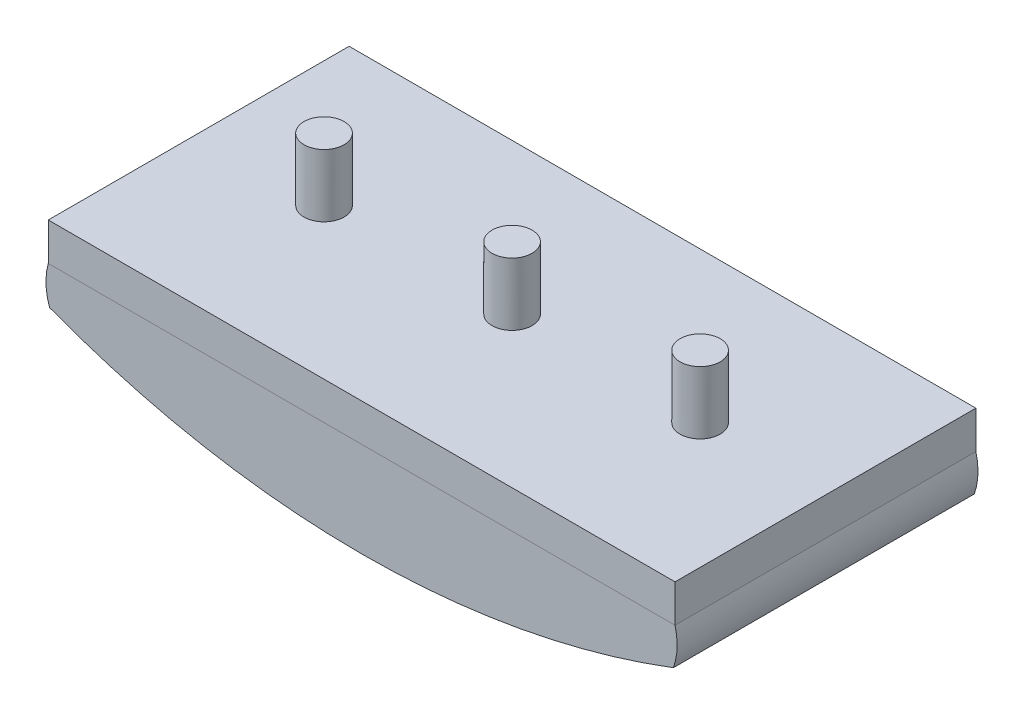
ISO-10303-21;
HEADER;
FILE_DESCRIPTION(('STEP AP214'),'2;1');
FILE_NAME('part.step','',(''),(''),'','','');
FILE_SCHEMA(('AUTOMOTIVE_DESIGN { 1 0 10303 214 1 1 1 1 }'));
ENDSEC;
DATA;
#1=APPLICATION_CONTEXT('core data for automotive mechanical design processes');
#2=APPLICATION_PROTOCOL_DEFINITION('international standard','automotive_design',2000,#1);
#3=PRODUCT_CONTEXT('',#1,'mechanical');
#4=PRODUCT('Part','Part','',(#3));
#5=PRODUCT_RELATED_PRODUCT_CATEGORY('part','',(#4));
#6=PRODUCT_DEFINITION_FORMATION('','',#4);
#7=PRODUCT_DEFINITION_CONTEXT('part definition',#1,'design');
#8=PRODUCT_DEFINITION('design','',#6,#7);
#9=PRODUCT_DEFINITION_SHAPE('','',#8);
#10=(LENGTH_UNIT() NAMED_UNIT(*) SI_UNIT(.MILLI.,.METRE.));
#11=(NAMED_UNIT(*) PLANE_ANGLE_UNIT() SI_UNIT($,.RADIAN.));
#12=(NAMED_UNIT(*) SI_UNIT($,.STERADIAN.) SOLID_ANGLE_UNIT());
#13=UNCERTAINTY_MEASURE_WITH_UNIT(LENGTH_MEASURE(1.E-05),#10,'distance_accuracy_value','');
#14=(GEOMETRIC_REPRESENTATION_CONTEXT(3) GLOBAL_UNCERTAINTY_ASSIGNED_CONTEXT((#13)) GLOBAL_UNIT_ASSIGNED_CONTEXT((#10,
#11,#12)) REPRESENTATION_CONTEXT('',''));
#15=CARTESIAN_POINT('',(0.,0.,0.));
#16=DIRECTION('',(0.,0.,1.));
#17=DIRECTION('',(1.,0.,0.));
#18=AXIS2_PLACEMENT_3D('',#15,#16,#17);
#19=CARTESIAN_POINT('',(4.81764805719499,-1.338008668509,0.));
#20=DIRECTION('',(0.,0.,-1.));
#21=DIRECTION('',(-1.,0.,0.));
#22=AXIS2_PLACEMENT_3D('',#19,#20,#21);
#23=CYLINDRICAL_SURFACE('',#22,5.);
#24=CARTESIAN_POINT('',(4.81764805719499,-1.338008668509,-24.));
#25=DIRECTION('',(0.,0.,-1.));
#26=DIRECTION('',(1.,0.,0.));
#27=AXIS2_PLACEMENT_3D('',#24,#25,#26);
#28=CIRCLE('',#27,5.);
#29=CARTESIAN_POINT('',(0.10195247604803,-2.99999999999999,-24.));
#30=VERTEX_POINT('',#29);
#31=CARTESIAN_POINT('',(0.,0.,-24.));
#32=VERTEX_POINT('',#31);
#33=EDGE_CURVE('E108',#30,#32,#28,.T.);
#34=ORIENTED_EDGE('',*,*,#33,.F.);
#35=DIRECTION('',(0.,0.,-1.));
#36=VECTOR('',#35,1.);
#37=CARTESIAN_POINT('',(0.10195247604803,-2.99999999999999,0.));
#38=LINE('',#37,#36);
#39=CARTESIAN_POINT('',(0.10195247604803,-2.99999999999999,0.));
#40=VERTEX_POINT('',#39);
#41=EDGE_CURVE('E12',#40,#30,#38,.T.);
#42=ORIENTED_EDGE('',*,*,#41,.F.);
#43=CARTESIAN_POINT('',(4.81764805719499,-1.338008668509,0.));
#44=DIRECTION('',(0.,0.,-1.));
#45=DIRECTION('',(1.,0.,0.));
#46=AXIS2_PLACEMENT_3D('',#43,#44,#45);
#47=CIRCLE('',#46,5.);
#48=CARTESIAN_POINT('',(0.,0.,0.));
#49=VERTEX_POINT('',#48);
#50=EDGE_CURVE('E102',#40,#49,#47,.T.);
#51=ORIENTED_EDGE('',*,*,#50,.T.);
#52=DIRECTION('',(0.,0.,-1.));
#53=VECTOR('',#52,1.);
#54=CARTESIAN_POINT('',(0.,0.,0.));
#55=LINE('',#54,#53);
#56=EDGE_CURVE('E47',#49,#32,#55,.T.);
#57=ORIENTED_EDGE('',*,*,#56,.T.);
#58=EDGE_LOOP('',(#34,#42,#51,#57));
#59=FACE_BOUND('',#58,.T.);
#60=ADVANCED_FACE('F44',(#59),#23,.T.);
#61=CARTESIAN_POINT('',(24.9845146144658,62.4282668380248,0.));
#62=DIRECTION('',(0.,0.,-1.));
#63=DIRECTION('',(-1.,0.,0.));
#64=AXIS2_PLACEMENT_3D('',#61,#62,#63);
#65=CYLINDRICAL_SURFACE('',#64,70.);
#66=CARTESIAN_POINT('',(24.9845146144658,62.4282668380248,-24.));
#67=DIRECTION('',(0.,0.,-1.));
#68=DIRECTION('',(1.,0.,0.));
#69=AXIS2_PLACEMENT_3D('',#66,#67,#68);
#70=CIRCLE('',#69,70.);
#71=CARTESIAN_POINT('',(49.8670767528836,-3.,-24.));
#72=VERTEX_POINT('',#71);
#73=EDGE_CURVE('E104',#72,#30,#70,.T.);
#74=ORIENTED_EDGE('',*,*,#73,.F.);
#75=DIRECTION('',(0.,0.,-1.));
#76=VECTOR('',#75,1.);
#77=CARTESIAN_POINT('',(49.8670767528836,-3.,0.));
#78=LINE('',#77,#76);
#79=CARTESIAN_POINT('',(49.8670767528836,-3.,0.));
#80=VERTEX_POINT('',#79);
#81=EDGE_CURVE('E53',#80,#72,#78,.T.);
#82=ORIENTED_EDGE('',*,*,#81,.F.);
#83=CARTESIAN_POINT('',(24.9845146144658,62.4282668380248,0.));
#84=DIRECTION('',(0.,0.,-1.));
#85=DIRECTION('',(1.,0.,0.));
#86=AXIS2_PLACEMENT_3D('',#83,#84,#85);
#87=CIRCLE('',#86,70.);
#88=EDGE_CURVE('E99',#80,#40,#87,.T.);
#89=ORIENTED_EDGE('',*,*,#88,.T.);
#90=ORIENTED_EDGE('',*,*,#41,.T.);
#91=EDGE_LOOP('',(#74,#82,#89,#90));
#92=FACE_BOUND('',#91,.T.);
#93=ADVANCED_FACE('F118',(#92),#65,.T.);
#94=CARTESIAN_POINT('',(45.1689799764267,-1.28889314213146,0.));
#95=DIRECTION('',(0.,0.,-1.));
#96=DIRECTION('',(-1.,0.,0.));
#97=AXIS2_PLACEMENT_3D('',#94,#95,#96);
#98=CYLINDRICAL_SURFACE('',#97,5.);
#99=CARTESIAN_POINT('',(45.1689799764267,-1.28889314213146,-24.));
#100=DIRECTION('',(0.,0.,-1.));
#101=DIRECTION('',(-1.,0.,0.));
#102=AXIS2_PLACEMENT_3D('',#99,#100,#101);
#103=CIRCLE('',#102,5.);
#104=CARTESIAN_POINT('',(50.,0.,-24.));
#105=VERTEX_POINT('',#104);
#106=EDGE_CURVE('E94',#105,#72,#103,.T.);
#107=ORIENTED_EDGE('',*,*,#106,.F.);
#108=DIRECTION('',(0.,0.,-1.));
#109=VECTOR('',#108,1.);
#110=CARTESIAN_POINT('',(50.,0.,0.));
#111=LINE('',#110,#109);
#112=CARTESIAN_POINT('',(50.,0.,0.));
#113=VERTEX_POINT('',#112);
#114=EDGE_CURVE('E89',#113,#105,#111,.T.);
#115=ORIENTED_EDGE('',*,*,#114,.F.);
#116=CARTESIAN_POINT('',(45.1689799764267,-1.28889314213146,0.));
#117=DIRECTION('',(0.,0.,-1.));
#118=DIRECTION('',(-1.,0.,0.));
#119=AXIS2_PLACEMENT_3D('',#116,#117,#118);
#120=CIRCLE('',#119,5.);
#121=EDGE_CURVE('E92',#113,#80,#120,.T.);
#122=ORIENTED_EDGE('',*,*,#121,.T.);
#123=ORIENTED_EDGE('',*,*,#81,.T.);
#124=EDGE_LOOP('',(#107,#115,#122,#123));
#125=FACE_BOUND('',#124,.T.);
#126=ADVANCED_FACE('F91',(#125),#98,.T.);
#127=CARTESIAN_POINT('',(0.,0.,0.));
#128=DIRECTION('',(0.,1.,0.));
#129=DIRECTION('',(0.,0.,1.));
#130=AXIS2_PLACEMENT_3D('',#127,#128,#129);
#131=PLANE('',#130);
#132=DIRECTION('',(1.,0.,0.));
#133=VECTOR('',#132,1.);
#134=CARTESIAN_POINT('',(0.,0.,-24.));
#135=LINE('',#134,#133);
#136=EDGE_CURVE('E111',#32,#105,#135,.T.);
#137=ORIENTED_EDGE('',*,*,#136,.F.);
#138=ORIENTED_EDGE('',*,*,#56,.F.);
#139=DIRECTION('',(1.,0.,0.));
#140=VECTOR('',#139,1.);
#141=CARTESIAN_POINT('',(0.,0.,0.));
#142=LINE('',#141,#140);
#143=EDGE_CURVE('E98',#49,#113,#142,.T.);
#144=ORIENTED_EDGE('',*,*,#143,.T.);
#145=ORIENTED_EDGE('',*,*,#114,.T.);
#146=EDGE_LOOP('',(#137,#138,#144,#145));
#147=FACE_BOUND('',#146,.T.);
#148=ADVANCED_FACE('F101',(#147),#131,.T.);
#149=CARTESIAN_POINT('',(4.81764805719499,-1.338008668509,0.));
#150=DIRECTION('',(0.,0.,1.));
#151=DIRECTION('',(1.,0.,0.));
#152=AXIS2_PLACEMENT_3D('',#149,#150,#151);
#153=PLANE('',#152);
#154=ORIENTED_EDGE('',*,*,#50,.F.);
#155=ORIENTED_EDGE('',*,*,#88,.F.);
#156=ORIENTED_EDGE('',*,*,#121,.F.);
#157=ORIENTED_EDGE('',*,*,#143,.F.);
#158=EDGE_LOOP('',(#154,#155,#156,#157));
#159=FACE_BOUND('',#158,.T.);
#160=ADVANCED_FACE('F97',(#159),#153,.T.);
#161=CARTESIAN_POINT('',(4.81764805719499,-1.338008668509,-24.));
#162=DIRECTION('',(0.,0.,1.));
#163=DIRECTION('',(1.,0.,0.));
#164=AXIS2_PLACEMENT_3D('',#161,#162,#163);
#165=PLANE('',#164);
#166=ORIENTED_EDGE('',*,*,#33,.T.);
#167=ORIENTED_EDGE('',*,*,#136,.T.);
#168=ORIENTED_EDGE('',*,*,#106,.T.);
#169=ORIENTED_EDGE('',*,*,#73,.T.);
#170=EDGE_LOOP('',(#166,#167,#168,#169));
#171=FACE_BOUND('',#170,.T.);
#172=ADVANCED_FACE('F117',(#171),#165,.F.);
#173=CLOSED_SHELL('',(#60,#93,#126,#148,#160,#172));
#174=MANIFOLD_SOLID_BREP('B2',#173);
#175=CARTESIAN_POINT('',(0.,3.,0.));
#176=DIRECTION('',(1.,0.,0.));
#177=DIRECTION('',(0.,0.,-1.));
#178=AXIS2_PLACEMENT_3D('',#175,#176,#177);
#179=PLANE('',#178);
#180=DIRECTION('',(0.,0.,1.));
#181=VECTOR('',#180,1.);
#182=CARTESIAN_POINT('',(0.,0.,0.));
#183=LINE('',#182,#181);
#184=CARTESIAN_POINT('',(0.,0.,-24.));
#185=VERTEX_POINT('',#184);
#186=CARTESIAN_POINT('',(0.,0.,0.));
#187=VERTEX_POINT('',#186);
#188=EDGE_CURVE('E234',#185,#187,#183,.T.);
#189=ORIENTED_EDGE('',*,*,#188,.T.);
#190=DIRECTION('',(0.,-1.,0.));
#191=VECTOR('',#190,1.);
#192=CARTESIAN_POINT('',(0.,3.,0.));
#193=LINE('',#192,#191);
#194=CARTESIAN_POINT('',(0.,3.,0.));
#195=VERTEX_POINT('',#194);
#196=EDGE_CURVE('E225',#195,#187,#193,.T.);
#197=ORIENTED_EDGE('',*,*,#196,.F.);
#198=DIRECTION('',(0.,0.,1.));
#199=VECTOR('',#198,1.);
#200=CARTESIAN_POINT('',(0.,3.,0.));
#201=LINE('',#200,#199);
#202=CARTESIAN_POINT('',(0.,3.,-24.));
#203=VERTEX_POINT('',#202);
#204=EDGE_CURVE('E219',#203,#195,#201,.T.);
#205=ORIENTED_EDGE('',*,*,#204,.F.);
#206=DIRECTION('',(0.,-1.,0.));
#207=VECTOR('',#206,1.);
#208=CARTESIAN_POINT('',(0.,3.,-24.));
#209=LINE('',#208,#207);
#210=EDGE_CURVE('E230',#203,#185,#209,.T.);
#211=ORIENTED_EDGE('',*,*,#210,.T.);
#212=EDGE_LOOP('',(#189,#197,#205,#211));
#213=FACE_BOUND('',#212,.T.);
#214=ADVANCED_FACE('F167',(#213),#179,.F.);
#215=CARTESIAN_POINT('',(0.,3.,0.));
#216=DIRECTION('',(0.,0.,-1.));
#217=DIRECTION('',(-1.,0.,0.));
#218=AXIS2_PLACEMENT_3D('',#215,#216,#217);
#219=PLANE('',#218);
#220=DIRECTION('',(1.,0.,0.));
#221=VECTOR('',#220,1.);
#222=CARTESIAN_POINT('',(0.,0.,0.));
#223=LINE('',#222,#221);
#224=CARTESIAN_POINT('',(50.,0.,0.));
#225=VERTEX_POINT('',#224);
#226=EDGE_CURVE('E224',#187,#225,#223,.T.);
#227=ORIENTED_EDGE('',*,*,#226,.T.);
#228=DIRECTION('',(0.,-1.,0.));
#229=VECTOR('',#228,1.);
#230=CARTESIAN_POINT('',(50.,3.,0.));
#231=LINE('',#230,#229);
#232=CARTESIAN_POINT('',(50.,3.,0.));
#233=VERTEX_POINT('',#232);
#234=EDGE_CURVE('E222',#233,#225,#231,.T.);
#235=ORIENTED_EDGE('',*,*,#234,.F.);
#236=DIRECTION('',(1.,0.,0.));
#237=VECTOR('',#236,1.);
#238=CARTESIAN_POINT('',(0.,3.,0.));
#239=LINE('',#238,#237);
#240=EDGE_CURVE('E214',#195,#233,#239,.T.);
#241=ORIENTED_EDGE('',*,*,#240,.F.);
#242=ORIENTED_EDGE('',*,*,#196,.T.);
#243=EDGE_LOOP('',(#227,#235,#241,#242));
#244=FACE_BOUND('',#243,.T.);
#245=ADVANCED_FACE('F223',(#244),#219,.F.);
#246=CARTESIAN_POINT('',(50.,3.,0.));
#247=DIRECTION('',(-1.,0.,0.));
#248=DIRECTION('',(0.,0.,1.));
#249=AXIS2_PLACEMENT_3D('',#246,#247,#248);
#250=PLANE('',#249);
#251=DIRECTION('',(0.,0.,-1.));
#252=VECTOR('',#251,1.);
#253=CARTESIAN_POINT('',(50.,0.,0.));
#254=LINE('',#253,#252);
#255=CARTESIAN_POINT('',(50.,0.,-24.));
#256=VERTEX_POINT('',#255);
#257=EDGE_CURVE('E200',#225,#256,#254,.T.);
#258=ORIENTED_EDGE('',*,*,#257,.T.);
#259=DIRECTION('',(0.,-1.,0.));
#260=VECTOR('',#259,1.);
#261=CARTESIAN_POINT('',(50.,3.,-24.));
#262=LINE('',#261,#260);
#263=CARTESIAN_POINT('',(50.,3.,-24.));
#264=VERTEX_POINT('',#263);
#265=EDGE_CURVE('E226',#264,#256,#262,.T.);
#266=ORIENTED_EDGE('',*,*,#265,.F.);
#267=DIRECTION('',(0.,0.,-1.));
#268=VECTOR('',#267,1.);
#269=CARTESIAN_POINT('',(50.,3.,0.));
#270=LINE('',#269,#268);
#271=EDGE_CURVE('E217',#233,#264,#270,.T.);
#272=ORIENTED_EDGE('',*,*,#271,.F.);
#273=ORIENTED_EDGE('',*,*,#234,.T.);
#274=EDGE_LOOP('',(#258,#266,#272,#273));
#275=FACE_BOUND('',#274,.T.);
#276=ADVANCED_FACE('F228',(#275),#250,.F.);
#277=CARTESIAN_POINT('',(0.,3.,-24.));
#278=DIRECTION('',(0.,0.,1.));
#279=DIRECTION('',(1.,0.,0.));
#280=AXIS2_PLACEMENT_3D('',#277,#278,#279);
#281=PLANE('',#280);
#282=DIRECTION('',(-1.,0.,0.));
#283=VECTOR('',#282,1.);
#284=CARTESIAN_POINT('',(0.,0.,-24.));
#285=LINE('',#284,#283);
#286=EDGE_CURVE('E206',#256,#185,#285,.T.);
#287=ORIENTED_EDGE('',*,*,#286,.T.);
#288=ORIENTED_EDGE('',*,*,#210,.F.);
#289=DIRECTION('',(-1.,0.,0.));
#290=VECTOR('',#289,1.);
#291=CARTESIAN_POINT('',(0.,3.,-24.));
#292=LINE('',#291,#290);
#293=EDGE_CURVE('E183',#264,#203,#292,.T.);
#294=ORIENTED_EDGE('',*,*,#293,.F.);
#295=ORIENTED_EDGE('',*,*,#265,.T.);
#296=EDGE_LOOP('',(#287,#288,#294,#295));
#297=FACE_BOUND('',#296,.T.);
#298=ADVANCED_FACE('F254',(#297),#281,.F.);
#299=CARTESIAN_POINT('',(0.,3.,0.));
#300=DIRECTION('',(0.,-1.,0.));
#301=DIRECTION('',(0.,0.,-1.));
#302=AXIS2_PLACEMENT_3D('',#299,#300,#301);
#303=PLANE('',#302);
#304=CARTESIAN_POINT('',(40.,3.,-12.));
#305=DIRECTION('',(0.,-1.,0.));
#306=DIRECTION('',(0.,0.,-1.));
#307=AXIS2_PLACEMENT_3D('',#304,#305,#306);
#308=CIRCLE('',#307,1.6);
#309=CARTESIAN_POINT('',(40.,3.,-13.6));
#310=VERTEX_POINT('',#309);
#311=EDGE_CURVE('E42',#310,#310,#308,.F.);
#312=ORIENTED_EDGE('',*,*,#311,.F.);
#313=EDGE_LOOP('',(#312));
#314=FACE_BOUND('',#313,.T.);
#315=CARTESIAN_POINT('',(25.,3.,-12.));
#316=DIRECTION('',(0.,-1.,0.));
#317=DIRECTION('',(0.,0.,-1.));
#318=AXIS2_PLACEMENT_3D('',#315,#316,#317);
#319=CIRCLE('',#318,1.6);
#320=CARTESIAN_POINT('',(25.,3.,-13.6));
#321=VERTEX_POINT('',#320);
#322=EDGE_CURVE('E175',#321,#321,#319,.F.);
#323=ORIENTED_EDGE('',*,*,#322,.F.);
#324=EDGE_LOOP('',(#323));
#325=FACE_BOUND('',#324,.T.);
#326=CARTESIAN_POINT('',(9.99999999999999,3.,-12.));
#327=DIRECTION('',(0.,-1.,0.));
#328=DIRECTION('',(0.,0.,-1.));
#329=AXIS2_PLACEMENT_3D('',#326,#327,#328);
#330=CIRCLE('',#329,1.6);
#331=CARTESIAN_POINT('',(9.99999999999999,3.,-13.6));
#332=VERTEX_POINT('',#331);
#333=EDGE_CURVE('E244',#332,#332,#330,.F.);
#334=ORIENTED_EDGE('',*,*,#333,.F.);
#335=EDGE_LOOP('',(#334));
#336=FACE_BOUND('',#335,.T.);
#337=ORIENTED_EDGE('',*,*,#204,.T.);
#338=ORIENTED_EDGE('',*,*,#240,.T.);
#339=ORIENTED_EDGE('',*,*,#271,.T.);
#340=ORIENTED_EDGE('',*,*,#293,.T.);
#341=EDGE_LOOP('',(#337,#338,#339,#340));
#342=FACE_BOUND('',#341,.T.);
#343=ADVANCED_FACE('F215',(#314,#325,#336,#342),#303,.F.);
#344=CARTESIAN_POINT('',(0.,0.,0.));
#345=DIRECTION('',(0.,-1.,0.));
#346=DIRECTION('',(0.,0.,-1.));
#347=AXIS2_PLACEMENT_3D('',#344,#345,#346);
#348=PLANE('',#347);
#349=ORIENTED_EDGE('',*,*,#188,.F.);
#350=ORIENTED_EDGE('',*,*,#286,.F.);
#351=ORIENTED_EDGE('',*,*,#257,.F.);
#352=ORIENTED_EDGE('',*,*,#226,.F.);
#353=EDGE_LOOP('',(#349,#350,#351,#352));
#354=FACE_BOUND('',#353,.T.);
#355=ADVANCED_FACE('F253',(#354),#348,.T.);
#356=CARTESIAN_POINT('',(9.99999999999999,8.,-12.));
#357=DIRECTION('',(0.,-1.,0.));
#358=DIRECTION('',(0.,0.,-1.));
#359=AXIS2_PLACEMENT_3D('',#356,#357,#358);
#360=CYLINDRICAL_SURFACE('',#359,1.6);
#361=CARTESIAN_POINT('',(9.99999999999999,8.,-12.));
#362=DIRECTION('',(0.,1.,0.));
#363=DIRECTION('',(0.,0.,1.));
#364=AXIS2_PLACEMENT_3D('',#361,#362,#363);
#365=CIRCLE('',#364,1.6);
#366=CARTESIAN_POINT('',(9.99999999999999,8.,-10.4));
#367=VERTEX_POINT('',#366);
#368=EDGE_CURVE('E237',#367,#367,#365,.T.);
#369=ORIENTED_EDGE('',*,*,#368,.F.);
#370=EDGE_LOOP('',(#369));
#371=FACE_BOUND('',#370,.T.);
#372=ORIENTED_EDGE('',*,*,#333,.T.);
#373=EDGE_LOOP('',(#372));
#374=FACE_BOUND('',#373,.T.);
#375=ADVANCED_FACE('F259',(#371,#374),#360,.T.);
#376=CARTESIAN_POINT('',(9.99999999999999,8.,-12.));
#377=DIRECTION('',(0.,1.,0.));
#378=DIRECTION('',(0.,0.,1.));
#379=AXIS2_PLACEMENT_3D('',#376,#377,#378);
#380=PLANE('',#379);
#381=ORIENTED_EDGE('',*,*,#368,.T.);
#382=EDGE_LOOP('',(#381));
#383=FACE_BOUND('',#382,.T.);
#384=ADVANCED_FACE('F261',(#383),#380,.T.);
#385=CARTESIAN_POINT('',(25.,8.,-12.));
#386=DIRECTION('',(0.,-1.,0.));
#387=DIRECTION('',(0.,0.,-1.));
#388=AXIS2_PLACEMENT_3D('',#385,#386,#387);
#389=CYLINDRICAL_SURFACE('',#388,1.6);
#390=CARTESIAN_POINT('',(25.,8.,-12.));
#391=DIRECTION('',(0.,1.,0.));
#392=DIRECTION('',(0.,0.,1.));
#393=AXIS2_PLACEMENT_3D('',#390,#391,#392);
#394=CIRCLE('',#393,1.6);
#395=CARTESIAN_POINT('',(25.,8.,-10.4));
#396=VERTEX_POINT('',#395);
#397=EDGE_CURVE('E367',#396,#396,#394,.T.);
#398=ORIENTED_EDGE('',*,*,#397,.F.);
#399=EDGE_LOOP('',(#398));
#400=FACE_BOUND('',#399,.T.);
#401=ORIENTED_EDGE('',*,*,#322,.T.);
#402=EDGE_LOOP('',(#401));
#403=FACE_BOUND('',#402,.T.);
#404=ADVANCED_FACE('F249',(#400,#403),#389,.T.);
#405=CARTESIAN_POINT('',(25.,8.,-12.));
#406=DIRECTION('',(0.,1.,0.));
#407=DIRECTION('',(0.,0.,1.));
#408=AXIS2_PLACEMENT_3D('',#405,#406,#407);
#409=PLANE('',#408);
#410=ORIENTED_EDGE('',*,*,#397,.T.);
#411=EDGE_LOOP('',(#410));
#412=FACE_BOUND('',#411,.T.);
#413=ADVANCED_FACE('F330',(#412),#409,.T.);
#414=CARTESIAN_POINT('',(40.,8.,-12.));
#415=DIRECTION('',(0.,-1.,0.));
#416=DIRECTION('',(0.,0.,-1.));
#417=AXIS2_PLACEMENT_3D('',#414,#415,#416);
#418=CYLINDRICAL_SURFACE('',#417,1.6);
#419=CARTESIAN_POINT('',(40.,8.,-12.));
#420=DIRECTION('',(0.,1.,0.));
#421=DIRECTION('',(0.,0.,1.));
#422=AXIS2_PLACEMENT_3D('',#419,#420,#421);
#423=CIRCLE('',#422,1.6);
#424=CARTESIAN_POINT('',(40.,8.,-10.4));
#425=VERTEX_POINT('',#424);
#426=EDGE_CURVE('E366',#425,#425,#423,.T.);
#427=ORIENTED_EDGE('',*,*,#426,.F.);
#428=EDGE_LOOP('',(#427));
#429=FACE_BOUND('',#428,.T.);
#430=ORIENTED_EDGE('',*,*,#311,.T.);
#431=EDGE_LOOP('',(#430));
#432=FACE_BOUND('',#431,.T.);
#433=ADVANCED_FACE('F339',(#429,#432),#418,.T.);
#434=CARTESIAN_POINT('',(40.,8.,-12.));
#435=DIRECTION('',(0.,1.,0.));
#436=DIRECTION('',(0.,0.,1.));
#437=AXIS2_PLACEMENT_3D('',#434,#435,#436);
#438=PLANE('',#437);
#439=ORIENTED_EDGE('',*,*,#426,.T.);
#440=EDGE_LOOP('',(#439));
#441=FACE_BOUND('',#440,.T.);
#442=ADVANCED_FACE('F348',(#441),#438,.T.);
#443=CLOSED_SHELL('',(#214,#245,#276,#298,#343,#355,#375,#384,#404,#413,#433,#442));
#444=MANIFOLD_SOLID_BREP('B6',#443);
#445=ADVANCED_BREP_SHAPE_REPRESENTATION('',(#18,#174,#444),#14);
#446=SHAPE_DEFINITION_REPRESENTATION(#9,#445);
ENDSEC;
END-ISO-10303-21;
